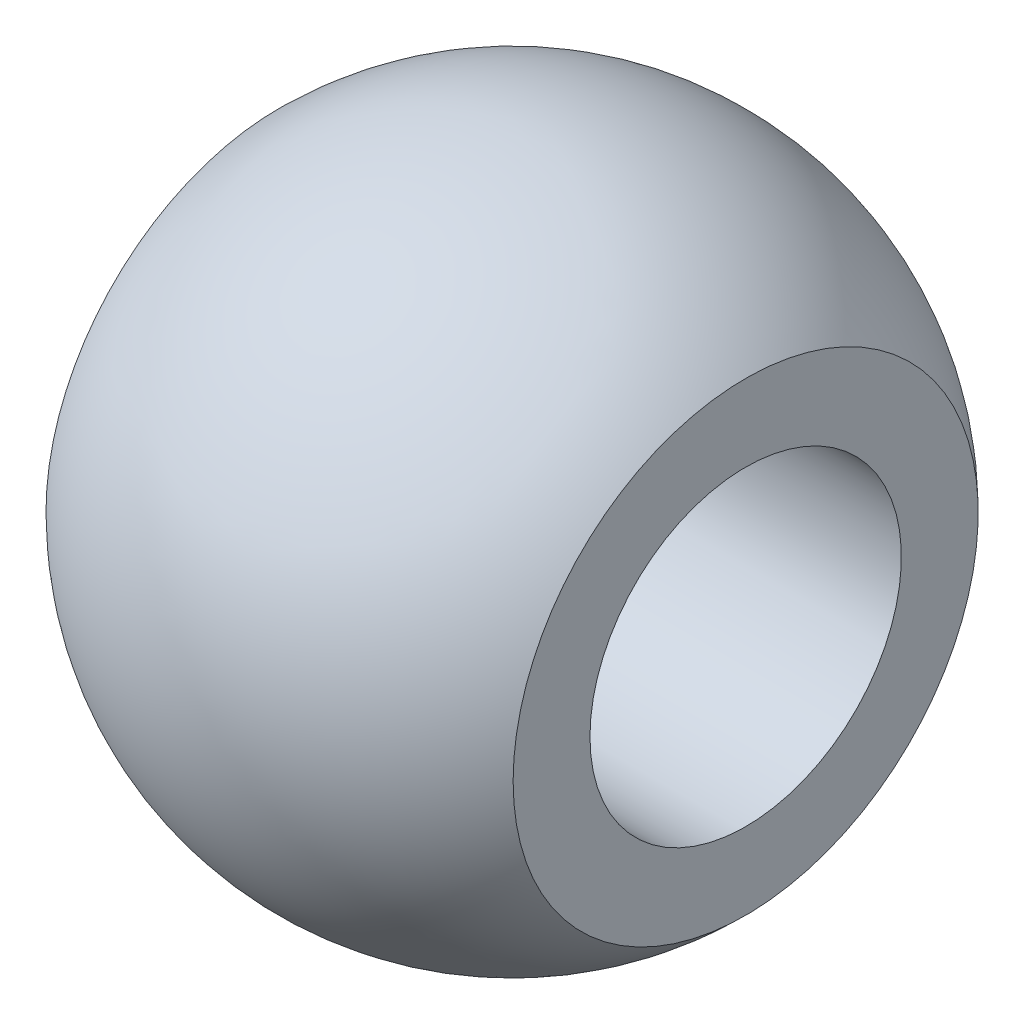
ISO-10303-21;
HEADER;
FILE_DESCRIPTION(('STEP AP214'),'2;1');
FILE_NAME('part.step','',(''),(''),'','','');
FILE_SCHEMA(('AUTOMOTIVE_DESIGN { 1 0 10303 214 1 1 1 1 }'));
ENDSEC;
DATA;
#1=APPLICATION_CONTEXT('core data for automotive mechanical design processes');
#2=APPLICATION_PROTOCOL_DEFINITION('international standard','automotive_design',2000,#1);
#3=PRODUCT_CONTEXT('',#1,'mechanical');
#4=PRODUCT('Part','Part','',(#3));
#5=PRODUCT_RELATED_PRODUCT_CATEGORY('part','',(#4));
#6=PRODUCT_DEFINITION_FORMATION('','',#4);
#7=PRODUCT_DEFINITION_CONTEXT('part definition',#1,'design');
#8=PRODUCT_DEFINITION('design','',#6,#7);
#9=PRODUCT_DEFINITION_SHAPE('','',#8);
#10=(LENGTH_UNIT() NAMED_UNIT(*) SI_UNIT(.MILLI.,.METRE.));
#11=(NAMED_UNIT(*) PLANE_ANGLE_UNIT() SI_UNIT($,.RADIAN.));
#12=(NAMED_UNIT(*) SI_UNIT($,.STERADIAN.) SOLID_ANGLE_UNIT());
#13=UNCERTAINTY_MEASURE_WITH_UNIT(LENGTH_MEASURE(1.E-05),#10,'distance_accuracy_value','');
#14=(GEOMETRIC_REPRESENTATION_CONTEXT(3) GLOBAL_UNCERTAINTY_ASSIGNED_CONTEXT((#13)) GLOBAL_UNIT_ASSIGNED_CONTEXT((#10,
#11,#12)) REPRESENTATION_CONTEXT('',''));
#15=CARTESIAN_POINT('',(0.,0.,0.));
#16=DIRECTION('',(0.,0.,1.));
#17=DIRECTION('',(1.,0.,0.));
#18=AXIS2_PLACEMENT_3D('',#15,#16,#17);
#19=CARTESIAN_POINT('',(0.,0.,0.));
#20=DIRECTION('',(-1.,0.,0.));
#21=DIRECTION('',(0.,1.,0.));
#22=AXIS2_PLACEMENT_3D('',#19,#20,#21);
#23=SPHERICAL_SURFACE('',#22,6.35);
#24=CARTESIAN_POINT('',(-4.5,0.,0.));
#25=DIRECTION('',(-1.,0.,0.));
#26=DIRECTION('',(0.,0.,1.));
#27=AXIS2_PLACEMENT_3D('',#24,#25,#26);
#28=CIRCLE('',#27,4.48023436886956);
#29=CARTESIAN_POINT('',(-4.5,0.,4.48023436886956));
#30=VERTEX_POINT('',#29);
#31=EDGE_CURVE('E10',#30,#30,#28,.T.);
#32=ORIENTED_EDGE('',*,*,#31,.F.);
#33=EDGE_LOOP('',(#32));
#34=FACE_BOUND('',#33,.T.);
#35=CARTESIAN_POINT('',(4.5,0.,0.));
#36=DIRECTION('',(-1.,0.,0.));
#37=DIRECTION('',(0.,0.,1.));
#38=AXIS2_PLACEMENT_3D('',#35,#36,#37);
#39=CIRCLE('',#38,4.48023436886956);
#40=CARTESIAN_POINT('',(4.5,0.,4.48023436886956));
#41=VERTEX_POINT('',#40);
#42=EDGE_CURVE('E46',#41,#41,#39,.T.);
#43=ORIENTED_EDGE('',*,*,#42,.T.);
#44=EDGE_LOOP('',(#43));
#45=FACE_BOUND('',#44,.T.);
#46=ADVANCED_FACE('F32',(#34,#45),#23,.T.);
#47=CARTESIAN_POINT('',(-4.5,4.48023436886956,0.));
#48=DIRECTION('',(1.,0.,0.));
#49=DIRECTION('',(0.,0.,-1.));
#50=AXIS2_PLACEMENT_3D('',#47,#48,#49);
#51=PLANE('',#50);
#52=CARTESIAN_POINT('',(-4.5,0.,0.));
#53=DIRECTION('',(-1.,0.,0.));
#54=DIRECTION('',(0.,0.,1.));
#55=AXIS2_PLACEMENT_3D('',#52,#53,#54);
#56=CIRCLE('',#55,3.);
#57=CARTESIAN_POINT('',(-4.5,0.,3.));
#58=VERTEX_POINT('',#57);
#59=EDGE_CURVE('E38',#58,#58,#56,.T.);
#60=ORIENTED_EDGE('',*,*,#59,.F.);
#61=EDGE_LOOP('',(#60));
#62=FACE_BOUND('',#61,.T.);
#63=ORIENTED_EDGE('',*,*,#31,.T.);
#64=EDGE_LOOP('',(#63));
#65=FACE_BOUND('',#64,.T.);
#66=ADVANCED_FACE('F61',(#62,#65),#51,.F.);
#67=CARTESIAN_POINT('',(-13.7198194539467,0.,0.));
#68=DIRECTION('',(-1.,0.,0.));
#69=DIRECTION('',(0.,0.,1.));
#70=AXIS2_PLACEMENT_3D('',#67,#68,#69);
#71=CYLINDRICAL_SURFACE('',#70,3.);
#72=CARTESIAN_POINT('',(4.5,0.,0.));
#73=DIRECTION('',(-1.,0.,0.));
#74=DIRECTION('',(0.,0.,1.));
#75=AXIS2_PLACEMENT_3D('',#72,#73,#74);
#76=CIRCLE('',#75,3.);
#77=CARTESIAN_POINT('',(4.5,0.,3.));
#78=VERTEX_POINT('',#77);
#79=EDGE_CURVE('E42',#78,#78,#76,.T.);
#80=ORIENTED_EDGE('',*,*,#79,.F.);
#81=EDGE_LOOP('',(#80));
#82=FACE_BOUND('',#81,.T.);
#83=ORIENTED_EDGE('',*,*,#59,.T.);
#84=EDGE_LOOP('',(#83));
#85=FACE_BOUND('',#84,.T.);
#86=ADVANCED_FACE('F56',(#82,#85),#71,.F.);
#87=CARTESIAN_POINT('',(4.5,4.48023436886956,0.));
#88=DIRECTION('',(-1.,0.,0.));
#89=DIRECTION('',(0.,0.,1.));
#90=AXIS2_PLACEMENT_3D('',#87,#88,#89);
#91=PLANE('',#90);
#92=ORIENTED_EDGE('',*,*,#42,.F.);
#93=EDGE_LOOP('',(#92));
#94=FACE_BOUND('',#93,.T.);
#95=ORIENTED_EDGE('',*,*,#79,.T.);
#96=EDGE_LOOP('',(#95));
#97=FACE_BOUND('',#96,.T.);
#98=ADVANCED_FACE('F53',(#94,#97),#91,.F.);
#99=CLOSED_SHELL('',(#46,#66,#86,#98));
#100=MANIFOLD_SOLID_BREP('B2',#99);
#101=ADVANCED_BREP_SHAPE_REPRESENTATION('',(#18,#100),#14);
#102=SHAPE_DEFINITION_REPRESENTATION(#9,#101);
ENDSEC;
END-ISO-10303-21;
